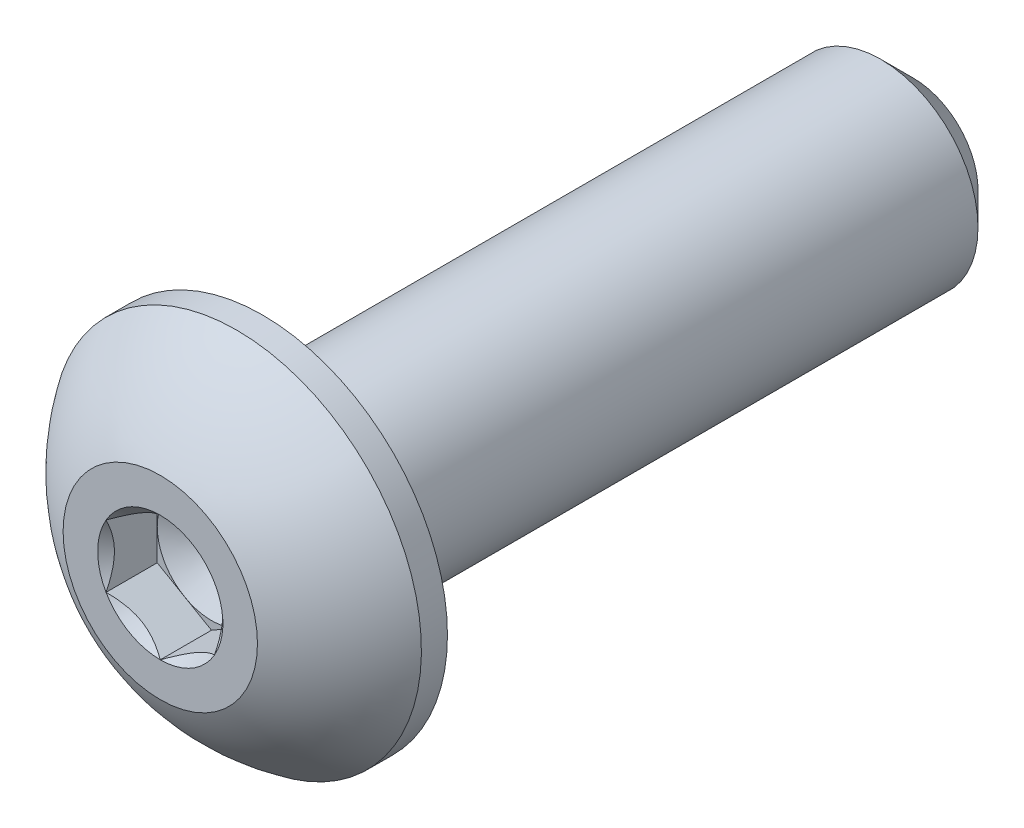
ISO-10303-21;
HEADER;
FILE_DESCRIPTION(('STEP AP214'),'2;1');
FILE_NAME('part.step','',(''),(''),'','','');
FILE_SCHEMA(('AUTOMOTIVE_DESIGN { 1 0 10303 214 1 1 1 1 }'));
ENDSEC;
DATA;
#1=APPLICATION_CONTEXT('core data for automotive mechanical design processes');
#2=APPLICATION_PROTOCOL_DEFINITION('international standard','automotive_design',2000,#1);
#3=PRODUCT_CONTEXT('',#1,'mechanical');
#4=PRODUCT('Part','Part','',(#3));
#5=PRODUCT_RELATED_PRODUCT_CATEGORY('part','',(#4));
#6=PRODUCT_DEFINITION_FORMATION('','',#4);
#7=PRODUCT_DEFINITION_CONTEXT('part definition',#1,'design');
#8=PRODUCT_DEFINITION('design','',#6,#7);
#9=PRODUCT_DEFINITION_SHAPE('','',#8);
#10=(LENGTH_UNIT() NAMED_UNIT(*) SI_UNIT(.MILLI.,.METRE.));
#11=(NAMED_UNIT(*) PLANE_ANGLE_UNIT() SI_UNIT($,.RADIAN.));
#12=(NAMED_UNIT(*) SI_UNIT($,.STERADIAN.) SOLID_ANGLE_UNIT());
#13=UNCERTAINTY_MEASURE_WITH_UNIT(LENGTH_MEASURE(1.E-05),#10,'distance_accuracy_value','');
#14=(GEOMETRIC_REPRESENTATION_CONTEXT(3) GLOBAL_UNCERTAINTY_ASSIGNED_CONTEXT((#13)) GLOBAL_UNIT_ASSIGNED_CONTEXT((#10,
#11,#12)) REPRESENTATION_CONTEXT('',''));
#15=CARTESIAN_POINT('',(0.,0.,0.));
#16=DIRECTION('',(0.,0.,1.));
#17=DIRECTION('',(1.,0.,0.));
#18=AXIS2_PLACEMENT_3D('',#15,#16,#17);
#19=CARTESIAN_POINT('',(0.79375,-1.3748153285078,0.7493));
#20=DIRECTION('',(0.,0.,1.));
#21=DIRECTION('',(1.,0.,0.));
#22=AXIS2_PLACEMENT_3D('',#19,#20,#21);
#23=PLANE('',#22);
#24=CARTESIAN_POINT('',(0.,0.,0.7493));
#25=DIRECTION('',(0.,0.,1.));
#26=DIRECTION('',(1.,0.,0.));
#27=AXIS2_PLACEMENT_3D('',#24,#25,#26);
#28=CIRCLE('',#27,0.79375);
#29=CARTESIAN_POINT('',(0.79375,0.,0.7493));
#30=VERTEX_POINT('',#29);
#31=CARTESIAN_POINT('',(0.396875,0.687407664253898,0.7493));
#32=VERTEX_POINT('',#31);
#33=EDGE_CURVE('E42',#30,#32,#28,.T.);
#34=ORIENTED_EDGE('',*,*,#33,.F.);
#35=DIRECTION('',(0.,1.,0.));
#36=VECTOR('',#35,1.);
#37=CARTESIAN_POINT('',(0.79375,-0.458271776169264,0.7493));
#38=LINE('',#37,#36);
#39=CARTESIAN_POINT('',(0.79375,0.458271776169267,0.7493));
#40=VERTEX_POINT('',#39);
#41=EDGE_CURVE('E112',#30,#40,#38,.T.);
#42=ORIENTED_EDGE('',*,*,#41,.T.);
#43=DIRECTION('',(-0.866025403784438,0.5,0.));
#44=VECTOR('',#43,1.);
#45=CARTESIAN_POINT('',(0.79375,0.458271776169267,0.7493));
#46=LINE('',#45,#44);
#47=EDGE_CURVE('E115',#40,#32,#46,.T.);
#48=ORIENTED_EDGE('',*,*,#47,.T.);
#49=EDGE_LOOP('',(#34,#42,#48));
#50=FACE_BOUND('',#49,.T.);
#51=ADVANCED_FACE('F31',(#50),#23,.T.);
#52=CARTESIAN_POINT('',(-0.396875,0.687407664253899,0.7493));
#53=VERTEX_POINT('',#52);
#54=EDGE_CURVE('E11',#32,#53,#28,.T.);
#55=ORIENTED_EDGE('',*,*,#54,.F.);
#56=CARTESIAN_POINT('',(0.,0.916543552338533,0.7493));
#57=VERTEX_POINT('',#56);
#58=EDGE_CURVE('E129',#32,#57,#46,.T.);
#59=ORIENTED_EDGE('',*,*,#58,.T.);
#60=DIRECTION('',(-0.866025403784439,-0.5,0.));
#61=VECTOR('',#60,1.);
#62=CARTESIAN_POINT('',(0.,0.916543552338533,0.7493));
#63=LINE('',#62,#61);
#64=EDGE_CURVE('E135',#57,#53,#63,.T.);
#65=ORIENTED_EDGE('',*,*,#64,.T.);
#66=EDGE_LOOP('',(#55,#59,#65));
#67=FACE_BOUND('',#66,.T.);
#68=ADVANCED_FACE('F191',(#67),#23,.T.);
#69=CARTESIAN_POINT('',(-0.79375,0.,0.7493));
#70=VERTEX_POINT('',#69);
#71=EDGE_CURVE('E40',#53,#70,#28,.T.);
#72=ORIENTED_EDGE('',*,*,#71,.F.);
#73=CARTESIAN_POINT('',(-0.79375,0.458271776169267,0.7493));
#74=VERTEX_POINT('',#73);
#75=EDGE_CURVE('E134',#53,#74,#63,.T.);
#76=ORIENTED_EDGE('',*,*,#75,.T.);
#77=DIRECTION('',(0.,-1.,0.));
#78=VECTOR('',#77,1.);
#79=CARTESIAN_POINT('',(-0.79375,0.458271776169267,0.7493));
#80=LINE('',#79,#78);
#81=EDGE_CURVE('E139',#74,#70,#80,.T.);
#82=ORIENTED_EDGE('',*,*,#81,.T.);
#83=EDGE_LOOP('',(#72,#76,#82));
#84=FACE_BOUND('',#83,.T.);
#85=ADVANCED_FACE('F196',(#84),#23,.T.);
#86=CARTESIAN_POINT('',(-0.396875,-0.687407664253898,0.7493));
#87=VERTEX_POINT('',#86);
#88=EDGE_CURVE('E226',#70,#87,#28,.T.);
#89=ORIENTED_EDGE('',*,*,#88,.F.);
#90=CARTESIAN_POINT('',(-0.79375,-0.458271776169264,0.7493));
#91=VERTEX_POINT('',#90);
#92=EDGE_CURVE('E138',#70,#91,#80,.T.);
#93=ORIENTED_EDGE('',*,*,#92,.T.);
#94=DIRECTION('',(0.866025403784439,-0.5,0.));
#95=VECTOR('',#94,1.);
#96=CARTESIAN_POINT('',(-0.79375,-0.458271776169264,0.7493));
#97=LINE('',#96,#95);
#98=EDGE_CURVE('E231',#91,#87,#97,.T.);
#99=ORIENTED_EDGE('',*,*,#98,.T.);
#100=EDGE_LOOP('',(#89,#93,#99));
#101=FACE_BOUND('',#100,.T.);
#102=ADVANCED_FACE('F214',(#101),#23,.T.);
#103=CARTESIAN_POINT('',(0.396874999999999,-0.687407664253897,0.7493));
#104=VERTEX_POINT('',#103);
#105=EDGE_CURVE('E49',#87,#104,#28,.T.);
#106=ORIENTED_EDGE('',*,*,#105,.F.);
#107=CARTESIAN_POINT('',(0.,-0.916543552338529,0.7493));
#108=VERTEX_POINT('',#107);
#109=EDGE_CURVE('E223',#87,#108,#97,.T.);
#110=ORIENTED_EDGE('',*,*,#109,.T.);
#111=DIRECTION('',(0.866025403784439,0.5,0.));
#112=VECTOR('',#111,1.);
#113=CARTESIAN_POINT('',(0.,-0.916543552338529,0.7493));
#114=LINE('',#113,#112);
#115=EDGE_CURVE('E124',#108,#104,#114,.T.);
#116=ORIENTED_EDGE('',*,*,#115,.T.);
#117=EDGE_LOOP('',(#106,#110,#116));
#118=FACE_BOUND('',#117,.T.);
#119=ADVANCED_FACE('F203',(#118),#23,.T.);
#120=CARTESIAN_POINT('',(0.,0.,0.));
#121=DIRECTION('',(0.,0.,-1.));
#122=DIRECTION('',(0.,1.,0.));
#123=AXIS2_PLACEMENT_3D('',#120,#121,#122);
#124=CYLINDRICAL_SURFACE('',#123,1.4224);
#125=CARTESIAN_POINT('',(0.,0.,-9.04875));
#126=DIRECTION('',(0.,0.,-1.));
#127=DIRECTION('',(0.,1.,0.));
#128=AXIS2_PLACEMENT_3D('',#125,#126,#127);
#129=CIRCLE('',#128,1.4224);
#130=CARTESIAN_POINT('',(0.,1.4224,-9.04875));
#131=VERTEX_POINT('',#130);
#132=EDGE_CURVE('E35',#131,#131,#129,.F.);
#133=ORIENTED_EDGE('',*,*,#132,.T.);
#134=EDGE_LOOP('',(#133));
#135=FACE_BOUND('',#134,.T.);
#136=CARTESIAN_POINT('',(0.,0.,0.));
#137=DIRECTION('',(0.,0.,1.));
#138=DIRECTION('',(1.,0.,0.));
#139=AXIS2_PLACEMENT_3D('',#136,#137,#138);
#140=CIRCLE('',#139,1.4224);
#141=CARTESIAN_POINT('',(1.4224,0.,0.));
#142=VERTEX_POINT('',#141);
#143=EDGE_CURVE('E166',#142,#142,#140,.F.);
#144=ORIENTED_EDGE('',*,*,#143,.T.);
#145=EDGE_LOOP('',(#144));
#146=FACE_BOUND('',#145,.T.);
#147=ADVANCED_FACE('F175',(#135,#146),#124,.T.);
#148=CARTESIAN_POINT('',(0.,0.,-9.525));
#149=DIRECTION('',(0.,0.,-1.));
#150=DIRECTION('',(0.,1.,0.));
#151=AXIS2_PLACEMENT_3D('',#148,#149,#150);
#152=PLANE('',#151);
#153=CARTESIAN_POINT('',(0.,0.,-9.525));
#154=DIRECTION('',(0.,0.,-1.));
#155=DIRECTION('',(0.,1.,0.));
#156=AXIS2_PLACEMENT_3D('',#153,#154,#155);
#157=CIRCLE('',#156,0.94615);
#158=CARTESIAN_POINT('',(0.,0.946150000000001,-9.525));
#159=VERTEX_POINT('',#158);
#160=EDGE_CURVE('E168',#159,#159,#157,.T.);
#161=ORIENTED_EDGE('',*,*,#160,.T.);
#162=EDGE_LOOP('',(#161));
#163=FACE_BOUND('',#162,.T.);
#164=ADVANCED_FACE('F181',(#163),#152,.T.);
#165=CARTESIAN_POINT('',(0.,0.,-9.525));
#166=DIRECTION('',(0.,0.,1.));
#167=DIRECTION('',(0.,-1.,0.));
#168=AXIS2_PLACEMENT_3D('',#165,#166,#167);
#169=CONICAL_SURFACE('',#168,0.94615,0.785398163397445);
#170=ORIENTED_EDGE('',*,*,#132,.F.);
#171=EDGE_LOOP('',(#170));
#172=FACE_BOUND('',#171,.T.);
#173=ORIENTED_EDGE('',*,*,#160,.F.);
#174=EDGE_LOOP('',(#173));
#175=FACE_BOUND('',#174,.T.);
#176=ADVANCED_FACE('F33',(#172,#175),#169,.T.);
#177=CARTESIAN_POINT('',(0.,0.,9.14977821515092));
#178=DIRECTION('',(0.,0.,-1.));
#179=DIRECTION('',(-1.,0.,0.));
#180=AXIS2_PLACEMENT_3D('',#177,#178,#179);
#181=CYLINDRICAL_SURFACE('',#180,2.7051);
#182=CARTESIAN_POINT('',(0.,0.,0.381));
#183=DIRECTION('',(0.,0.,-1.));
#184=DIRECTION('',(0.,1.,0.));
#185=AXIS2_PLACEMENT_3D('',#182,#183,#184);
#186=CIRCLE('',#185,2.7051);
#187=CARTESIAN_POINT('',(0.,2.7051,0.381));
#188=VERTEX_POINT('',#187);
#189=EDGE_CURVE('E160',#188,#188,#186,.T.);
#190=ORIENTED_EDGE('',*,*,#189,.T.);
#191=EDGE_LOOP('',(#190));
#192=FACE_BOUND('',#191,.T.);
#193=CARTESIAN_POINT('',(0.,0.,0.));
#194=DIRECTION('',(0.,0.,1.));
#195=DIRECTION('',(1.,0.,0.));
#196=AXIS2_PLACEMENT_3D('',#193,#194,#195);
#197=CIRCLE('',#196,2.7051);
#198=CARTESIAN_POINT('',(2.7051,0.,0.));
#199=VERTEX_POINT('',#198);
#200=EDGE_CURVE('E163',#199,#199,#197,.T.);
#201=ORIENTED_EDGE('',*,*,#200,.T.);
#202=EDGE_LOOP('',(#201));
#203=FACE_BOUND('',#202,.T.);
#204=ADVANCED_FACE('F180',(#192,#203),#181,.T.);
#205=CARTESIAN_POINT('',(0.,0.,0.));
#206=DIRECTION('',(0.,0.,1.));
#207=DIRECTION('',(1.,0.,0.));
#208=AXIS2_PLACEMENT_3D('',#205,#206,#207);
#209=PLANE('',#208);
#210=ORIENTED_EDGE('',*,*,#143,.F.);
#211=EDGE_LOOP('',(#210));
#212=FACE_BOUND('',#211,.T.);
#213=ORIENTED_EDGE('',*,*,#200,.F.);
#214=EDGE_LOOP('',(#213));
#215=FACE_BOUND('',#214,.T.);
#216=ADVANCED_FACE('F186',(#212,#215),#209,.F.);
#217=CARTESIAN_POINT('',(0.,0.,-1.42882215909091));
#218=DIRECTION('',(0.,0.,-1.));
#219=DIRECTION('',(0.,1.,0.));
#220=AXIS2_PLACEMENT_3D('',#217,#218,#219);
#221=SPHERICAL_SURFACE('',#220,3.25469234452912);
#222=ORIENTED_EDGE('',*,*,#189,.F.);
#223=EDGE_LOOP('',(#222));
#224=FACE_BOUND('',#223,.T.);
#225=CARTESIAN_POINT('',(0.,0.,1.4986));
#226=DIRECTION('',(0.,0.,-1.));
#227=DIRECTION('',(0.,1.,0.));
#228=AXIS2_PLACEMENT_3D('',#225,#226,#227);
#229=CIRCLE('',#228,1.4224);
#230=CARTESIAN_POINT('',(0.,1.4224,1.4986));
#231=VERTEX_POINT('',#230);
#232=EDGE_CURVE('E146',#231,#231,#229,.T.);
#233=ORIENTED_EDGE('',*,*,#232,.T.);
#234=EDGE_LOOP('',(#233));
#235=FACE_BOUND('',#234,.T.);
#236=ADVANCED_FACE('F425',(#224,#235),#221,.T.);
#237=CARTESIAN_POINT('',(0.,0.,1.4986));
#238=DIRECTION('',(0.,0.,1.));
#239=DIRECTION('',(1.,0.,0.));
#240=AXIS2_PLACEMENT_3D('',#237,#238,#239);
#241=PLANE('',#240);
#242=CARTESIAN_POINT('',(0.,0.,1.4986));
#243=DIRECTION('',(0.,0.,1.));
#244=DIRECTION('',(1.,0.,0.));
#245=AXIS2_PLACEMENT_3D('',#242,#243,#244);
#246=CIRCLE('',#245,0.916543552338529);
#247=CARTESIAN_POINT('',(0.79375,0.458271776169263,1.4986));
#248=VERTEX_POINT('',#247);
#249=CARTESIAN_POINT('',(0.,0.916543552338529,1.4986));
#250=VERTEX_POINT('',#249);
#251=EDGE_CURVE('E486',#248,#250,#246,.T.);
#252=ORIENTED_EDGE('',*,*,#251,.F.);
#253=CARTESIAN_POINT('',(0.79375,-0.458271776169264,1.4986));
#254=VERTEX_POINT('',#253);
#255=EDGE_CURVE('E490',#254,#248,#246,.T.);
#256=ORIENTED_EDGE('',*,*,#255,.F.);
#257=CARTESIAN_POINT('',(0.,-0.916543552338529,1.4986));
#258=VERTEX_POINT('',#257);
#259=EDGE_CURVE('E496',#258,#254,#246,.T.);
#260=ORIENTED_EDGE('',*,*,#259,.F.);
#261=CARTESIAN_POINT('',(-0.79375,-0.458271776169262,1.4986));
#262=VERTEX_POINT('',#261);
#263=EDGE_CURVE('E499',#262,#258,#246,.T.);
#264=ORIENTED_EDGE('',*,*,#263,.F.);
#265=CARTESIAN_POINT('',(-0.793749999999995,0.45827177616927,1.4986));
#266=VERTEX_POINT('',#265);
#267=EDGE_CURVE('E56',#266,#262,#246,.T.);
#268=ORIENTED_EDGE('',*,*,#267,.F.);
#269=EDGE_CURVE('E491',#250,#266,#246,.T.);
#270=ORIENTED_EDGE('',*,*,#269,.F.);
#271=EDGE_LOOP('',(#252,#256,#260,#264,#268,#270));
#272=FACE_BOUND('',#271,.T.);
#273=ORIENTED_EDGE('',*,*,#232,.F.);
#274=EDGE_LOOP('',(#273));
#275=FACE_BOUND('',#274,.T.);
#276=ADVANCED_FACE('F403',(#272,#275),#241,.T.);
#277=CARTESIAN_POINT('',(0.,0.,1.4986));
#278=DIRECTION('',(0.,0.,1.));
#279=DIRECTION('',(1.,0.,0.));
#280=AXIS2_PLACEMENT_3D('',#277,#278,#279);
#281=CONICAL_SURFACE('',#280,0.916543552338529,0.78539816339745);
#282=ORIENTED_EDGE('',*,*,#259,.T.);
#283=CARTESIAN_POINT('',(-0.000200000000000455,-0.916659022392367,1.4987154918722));
#284=CARTESIAN_POINT('',(0.0270936731708993,-0.900901012839974,1.48296677881996));
#285=CARTESIAN_POINT('',(0.0548437622982907,-0.884879491412239,1.46814254758418));
#286=CARTESIAN_POINT('',(0.111429749536839,-0.852209556447702,1.44099903778594));
#287=CARTESIAN_POINT('',(0.140271036646688,-0.835558031571056,1.42869487372838));
#288=CARTESIAN_POINT('',(0.198428320979554,-0.801980907806138,1.4076173665706));
#289=CARTESIAN_POINT('',(0.227729485202779,-0.78506387275429,1.39879100814755));
#290=CARTESIAN_POINT('',(0.286976842886976,-0.750857394846545,1.38519123872424));
#291=CARTESIAN_POINT('',(0.316921224361637,-0.733568998141432,1.38040766812998));
#292=CARTESIAN_POINT('',(0.368524622466451,-0.703775762354518,1.37609340945595));
#293=CARTESIAN_POINT('',(0.390116468258511,-0.691309704374172,1.37545527141097));
#294=CARTESIAN_POINT('',(0.433258367277031,-0.666401717362478,1.37652613979119));
#295=CARTESIAN_POINT('',(0.454808410236484,-0.65395979425879,1.37823566388179));
#296=CARTESIAN_POINT('',(0.519150845544782,-0.616811671913228,1.38677279115859));
#297=CARTESIAN_POINT('',(0.561623053980694,-0.592290330939676,1.39700991913679));
#298=CARTESIAN_POINT('',(0.636174390780281,-0.549248096569988,1.42171858984055));
#299=CARTESIAN_POINT('',(0.668602787817666,-0.530525552811065,1.43489617467531));
#300=CARTESIAN_POINT('',(0.732189146461483,-0.49381395153127,1.46458103995168));
#301=CARTESIAN_POINT('',(0.763350854631517,-0.475822730930892,1.48107748789317));
#302=CARTESIAN_POINT('',(0.79395,-0.458156306115426,1.4987154918722));
#303=B_SPLINE_CURVE_WITH_KNOTS('',3,(#283,#284,#285,#286,#287,#288,#289,#290,#291,#292,#293,
#294,#295,#296,#297,#298,#299,#300,#301,#302),.UNSPECIFIED.,.F.,.F.,(4,2,2,2,2,2,2,2,2,4),(0.,
0.105768699105621,0.21215429718622,0.316848842533858,0.421279499712345,0.495991864977073,
0.570720707151282,0.720221070373883,0.839150369964801,0.957697614118391),.UNSPECIFIED.);
#304=EDGE_CURVE('E256',#258,#254,#303,.T.);
#305=ORIENTED_EDGE('',*,*,#304,.F.);
#306=EDGE_LOOP('',(#282,#305));
#307=FACE_BOUND('',#306,.T.);
#308=ADVANCED_FACE('F212',(#307),#281,.F.);
#309=ORIENTED_EDGE('',*,*,#255,.T.);
#310=CARTESIAN_POINT('',(0.79375,-0.930523312873779,1.80513154686903));
#311=CARTESIAN_POINT('',(0.79375,-0.907938717568108,1.78795163801993));
#312=CARTESIAN_POINT('',(0.79375,-0.885230100372018,1.77093524884748));
#313=CARTESIAN_POINT('',(0.79375,-0.83951390138625,1.73729754968507));
#314=CARTESIAN_POINT('',(0.79375,-0.81650624817287,1.72067633686699));
#315=CARTESIAN_POINT('',(0.79375,-0.746621435652652,1.67127015014611));
#316=CARTESIAN_POINT('',(0.79375,-0.699225496572676,1.63920694226179));
#317=CARTESIAN_POINT('',(0.79375,-0.599729870318619,1.57610938356628));
#318=CARTESIAN_POINT('',(0.79375,-0.547518111602845,1.54524980287807));
#319=CARTESIAN_POINT('',(0.79375,-0.440465997521066,1.48869431939161));
#320=CARTESIAN_POINT('',(0.79375,-0.385635319588842,1.462980990208));
#321=CARTESIAN_POINT('',(0.79375,-0.303490919645501,1.43151828592316));
#322=CARTESIAN_POINT('',(0.79375,-0.277428588623871,1.42251658488986));
#323=CARTESIAN_POINT('',(0.79375,-0.224660266267594,1.40660365805206));
#324=CARTESIAN_POINT('',(0.79375,-0.197954232107697,1.39969257175189));
#325=CARTESIAN_POINT('',(0.79375,-0.144516677526958,1.38844073487269));
#326=CARTESIAN_POINT('',(0.79375,-0.117794877403843,1.38405455104384));
#327=CARTESIAN_POINT('',(0.79375,-0.0640385307880295,1.37793807645136));
#328=CARTESIAN_POINT('',(0.79375,-0.037003941658247,1.37620815217119));
#329=CARTESIAN_POINT('',(0.79375,0.0160384595788292,1.37554283034023));
#330=CARTESIAN_POINT('',(0.79375,0.0420449606060605,1.37650050108268));
#331=CARTESIAN_POINT('',(0.79375,0.093845497213574,1.38091790993338));
#332=CARTESIAN_POINT('',(0.79375,0.11963949213758,1.38437811607282));
#333=CARTESIAN_POINT('',(0.79375,0.171261622869057,1.39366770326333));
#334=CARTESIAN_POINT('',(0.79375,0.197082302323078,1.3995378826003));
#335=CARTESIAN_POINT('',(0.79375,0.248157270984135,1.4133304606982));
#336=CARTESIAN_POINT('',(0.79375,0.273411601594531,1.42125270890617));
#337=CARTESIAN_POINT('',(0.79375,0.352183480672703,1.44896346635406));
#338=CARTESIAN_POINT('',(0.79375,0.404598779993784,1.4718769639291));
#339=CARTESIAN_POINT('',(0.79375,0.506973354577988,1.5228423731992));
#340=CARTESIAN_POINT('',(0.79375,0.556923045144656,1.55091259799278));
#341=CARTESIAN_POINT('',(0.79375,0.652394168745675,1.60884556234195));
#342=CARTESIAN_POINT('',(0.79375,0.698012407471607,1.63855075951651));
#343=CARTESIAN_POINT('',(0.79375,0.765221422184928,1.68448125421725));
#344=CARTESIAN_POINT('',(0.79375,0.787334753284685,1.69995518303451));
#345=CARTESIAN_POINT('',(0.79375,0.831258721493259,1.73131476145367));
#346=CARTESIAN_POINT('',(0.79375,0.853069439825473,1.74720029716127));
#347=CARTESIAN_POINT('',(0.79375,0.874754064753108,1.76325657308564));
#348=B_SPLINE_CURVE_WITH_KNOTS('',3,(#310,#311,#312,#313,#314,#315,#316,#317,#318,#319,#320,
#321,#322,#323,#324,#325,#326,#327,#328,#329,#330,#331,#332,#333,#334,#335,#336,#337,#338,#339,
#340,#341,#342,#343,#344,#345,#346,#347),.UNSPECIFIED.,.F.,.F.,(4,2,2,2,2,2,2,2,2,2,2,2,2,2,2,2,
2,2,4),(0.,0.0851267212699211,0.170274162697199,0.341867540062669,0.523672188154065,
0.704850381262152,0.787500098686151,0.870155330015478,0.951272603586192,1.03240106788106,
1.11034793766582,1.18830938906372,1.26764895162694,1.34698269497801,1.51809534529198,
1.68982784691028,1.85305831881697,1.93402417500375,2.01496786175293),.UNSPECIFIED.);
#349=EDGE_CURVE('E264',#254,#248,#348,.T.);
#350=ORIENTED_EDGE('',*,*,#349,.F.);
#351=EDGE_LOOP('',(#309,#350));
#352=FACE_BOUND('',#351,.T.);
#353=ADVANCED_FACE('F388',(#352),#281,.F.);
#354=ORIENTED_EDGE('',*,*,#251,.T.);
#355=CARTESIAN_POINT('',(0.793949999999999,0.458156306115429,1.4987154918722));
#356=CARTESIAN_POINT('',(0.7666563268291,0.473914315667822,1.48296677881996));
#357=CARTESIAN_POINT('',(0.738906237701709,0.489935837095558,1.46814254758418));
#358=CARTESIAN_POINT('',(0.68232025046316,0.522605772060094,1.44099903778594));
#359=CARTESIAN_POINT('',(0.653478963353312,0.53925729693674,1.42869487372838));
#360=CARTESIAN_POINT('',(0.595321679020446,0.572834420701658,1.4076173665706));
#361=CARTESIAN_POINT('',(0.566020514797221,0.589751455753507,1.39879100814755));
#362=CARTESIAN_POINT('',(0.506773157113025,0.623957933661252,1.38519123872424));
#363=CARTESIAN_POINT('',(0.476828775638364,0.641246330366364,1.38040766812999));
#364=CARTESIAN_POINT('',(0.425225377533549,0.671039566153278,1.37609340945595));
#365=CARTESIAN_POINT('',(0.40363353174149,0.683505624133624,1.37545527141097));
#366=CARTESIAN_POINT('',(0.360491632722969,0.708413611145319,1.3765261397912));
#367=CARTESIAN_POINT('',(0.338941589763516,0.720855534249007,1.37823566388179));
#368=CARTESIAN_POINT('',(0.274599154455218,0.758003656594569,1.3867727911586));
#369=CARTESIAN_POINT('',(0.232126946019306,0.782524997568121,1.3970099191368));
#370=CARTESIAN_POINT('',(0.157575609219719,0.825567231937809,1.42171858984055));
#371=CARTESIAN_POINT('',(0.125147212182333,0.844289775696731,1.43489617467531));
#372=CARTESIAN_POINT('',(0.0615608535385166,0.881001376976527,1.46458103995168));
#373=CARTESIAN_POINT('',(0.0303991453684829,0.898992597576905,1.48107748789317));
#374=CARTESIAN_POINT('',(-0.000200000000000255,0.916659022392371,1.4987154918722));
#375=B_SPLINE_CURVE_WITH_KNOTS('',3,(#355,#356,#357,#358,#359,#360,#361,#362,#363,#364,#365,
#366,#367,#368,#369,#370,#371,#372,#373,#374),.UNSPECIFIED.,.F.,.F.,(4,2,2,2,2,2,2,2,2,4),(0.,
0.105768699105621,0.212154297186219,0.316848842533857,0.421279499712344,0.495991864977072,
0.570720707151281,0.720221070373882,0.8391503699648,0.957697614118391),.UNSPECIFIED.);
#376=EDGE_CURVE('E271',#248,#250,#375,.T.);
#377=ORIENTED_EDGE('',*,*,#376,.F.);
#378=EDGE_LOOP('',(#354,#377));
#379=FACE_BOUND('',#378,.T.);
#380=ADVANCED_FACE('F380',(#379),#281,.F.);
#381=ORIENTED_EDGE('',*,*,#269,.T.);
#382=CARTESIAN_POINT('',(0.00019999999999984,0.916659022392371,1.4987154918722));
#383=CARTESIAN_POINT('',(-0.0270936731709001,0.900901012839978,1.48296677881996));
#384=CARTESIAN_POINT('',(-0.0548437622982915,0.884879491412243,1.46814254758418));
#385=CARTESIAN_POINT('',(-0.11142974953684,0.852209556447706,1.44099903778594));
#386=CARTESIAN_POINT('',(-0.140271036646689,0.835558031571059,1.42869487372838));
#387=CARTESIAN_POINT('',(-0.198428320979556,0.801980907806141,1.4076173665706));
#388=CARTESIAN_POINT('',(-0.22772948520278,0.785063872754293,1.39879100814755));
#389=CARTESIAN_POINT('',(-0.286976842886977,0.750857394846548,1.38519123872424));
#390=CARTESIAN_POINT('',(-0.316921224361638,0.733568998141436,1.38040766812999));
#391=CARTESIAN_POINT('',(-0.368524622466453,0.703775762354521,1.37609340945595));
#392=CARTESIAN_POINT('',(-0.390116468258512,0.691309704374175,1.37545527141097));
#393=CARTESIAN_POINT('',(-0.433258367277033,0.666401717362481,1.3765261397912));
#394=CARTESIAN_POINT('',(-0.454808410236486,0.653959794258792,1.37823566388179));
#395=CARTESIAN_POINT('',(-0.519150845544784,0.61681167191323,1.3867727911586));
#396=CARTESIAN_POINT('',(-0.561623053980697,0.592290330939678,1.3970099191368));
#397=CARTESIAN_POINT('',(-0.636174390780283,0.549248096569991,1.42171858984055));
#398=CARTESIAN_POINT('',(-0.668602787817668,0.530525552811068,1.43489617467531));
#399=CARTESIAN_POINT('',(-0.732189146461484,0.493813951531273,1.46458103995168));
#400=CARTESIAN_POINT('',(-0.763350854631517,0.475822730930895,1.48107748789317));
#401=CARTESIAN_POINT('',(-0.79395,0.45815630611543,1.4987154918722));
#402=B_SPLINE_CURVE_WITH_KNOTS('',3,(#382,#383,#384,#385,#386,#387,#388,#389,#390,#391,#392,
#393,#394,#395,#396,#397,#398,#399,#400,#401),.UNSPECIFIED.,.F.,.F.,(4,2,2,2,2,2,2,2,2,4),(0.,
0.105768699105622,0.21215429718622,0.316848842533859,0.421279499712347,0.495991864977074,
0.570720707151284,0.720221070373885,0.839150369964802,0.957697614118391),.UNSPECIFIED.);
#403=EDGE_CURVE('E276',#250,#266,#402,.T.);
#404=ORIENTED_EDGE('',*,*,#403,.F.);
#405=EDGE_LOOP('',(#381,#404));
#406=FACE_BOUND('',#405,.T.);
#407=ADVANCED_FACE('F373',(#406),#281,.F.);
#408=ORIENTED_EDGE('',*,*,#267,.T.);
#409=CARTESIAN_POINT('',(-0.79375,-0.930523312845418,1.80513154684746));
#410=CARTESIAN_POINT('',(-0.79375,-0.907938717540552,1.78795163799919));
#411=CARTESIAN_POINT('',(-0.79375,-0.88523010034527,1.77093524882756));
#412=CARTESIAN_POINT('',(-0.79375,-0.839513901361125,1.73729754966682));
#413=CARTESIAN_POINT('',(-0.79375,-0.816506248148561,1.72067633684956));
#414=CARTESIAN_POINT('',(-0.79375,-0.746621435630839,1.67127015013118));
#415=CARTESIAN_POINT('',(-0.79375,-0.69922549655256,1.63920694224851));
#416=CARTESIAN_POINT('',(-0.79375,-0.599729870302204,1.57610938355642));
#417=CARTESIAN_POINT('',(-0.79375,-0.547518111588444,1.54524980286995));
#418=CARTESIAN_POINT('',(-0.79375,-0.440465997510864,1.48869431938673));
#419=CARTESIAN_POINT('',(-0.79375,-0.385635319580823,1.46298099020461));
#420=CARTESIAN_POINT('',(-0.79375,-0.30349091963912,1.43151828592086));
#421=CARTESIAN_POINT('',(-0.79375,-0.277428588616795,1.4225165848875));
#422=CARTESIAN_POINT('',(-0.79375,-0.224660266259103,1.40660365804972));
#423=CARTESIAN_POINT('',(-0.79375,-0.197954232098486,1.39969257174964));
#424=CARTESIAN_POINT('',(-0.79375,-0.144516677516331,1.38844073487076));
#425=CARTESIAN_POINT('',(-0.79375,-0.11779487739252,1.38405455104215));
#426=CARTESIAN_POINT('',(-0.79375,-0.0640385307753352,1.37793807645032));
#427=CARTESIAN_POINT('',(-0.79375,-0.0370039416448776,1.37620815217055));
#428=CARTESIAN_POINT('',(-0.79375,0.0160384595934048,1.37554283034051));
#429=CARTESIAN_POINT('',(-0.79375,0.0420449606211689,1.37650050108347));
#430=CARTESIAN_POINT('',(-0.79375,0.0938454972296932,1.38091790993526));
#431=CARTESIAN_POINT('',(-0.79375,0.119639492154177,1.38437811607528));
#432=CARTESIAN_POINT('',(-0.79375,0.171261622886597,1.39366770326701));
#433=CARTESIAN_POINT('',(-0.79375,0.197082302341082,1.39953788260463));
#434=CARTESIAN_POINT('',(-0.79375,0.24815727100302,1.41333046070383));
#435=CARTESIAN_POINT('',(-0.79375,0.273411601613832,1.42125270891245));
#436=CARTESIAN_POINT('',(-0.793750000000001,0.352183480696166,1.44896346636341));
#437=CARTESIAN_POINT('',(-0.79375,0.404598780020782,1.47187696394126));
#438=CARTESIAN_POINT('',(-0.79375,0.506973354611786,1.52284237321731));
#439=CARTESIAN_POINT('',(-0.79375,0.556923045181717,1.55091259801402));
#440=CARTESIAN_POINT('',(-0.79375,0.652394168788597,1.60884556236918));
#441=CARTESIAN_POINT('',(-0.793750000000001,0.69801240751715,1.63855075954657));
#442=CARTESIAN_POINT('',(-0.793750000000001,0.765221422234345,1.68448125425154));
#443=CARTESIAN_POINT('',(-0.793750000000001,0.787334753335375,1.69995518307021));
#444=CARTESIAN_POINT('',(-0.793750000000001,0.831258721546487,1.73131476149216));
#445=CARTESIAN_POINT('',(-0.793750000000001,0.853069439879965,1.74720029720116));
#446=CARTESIAN_POINT('',(-0.793750000000001,0.874754064808862,1.76325657312693));
#447=B_SPLINE_CURVE_WITH_KNOTS('',3,(#409,#410,#411,#412,#413,#414,#415,#416,#417,#418,#419,
#420,#421,#422,#423,#424,#425,#426,#427,#428,#429,#430,#431,#432,#433,#434,#435,#436,#437,#438,
#439,#440,#441,#442,#443,#444,#445,#446),.UNSPECIFIED.,.F.,.F.,(4,2,2,2,2,2,2,2,2,2,2,2,2,2,2,2,
2,2,4),(0.,0.085126721266486,0.170274162690328,0.341867540048798,0.523672188132332,
0.704850381232633,0.787500098658654,0.87015532999,0.951272603562646,1.03240106785945,
1.11034793764585,1.1883093890454,1.26764895161041,1.34698269496326,1.51809534529028,
1.68982784692171,1.85305831883963,1.93402417503194,2.01496786178666),.UNSPECIFIED.);
#448=EDGE_CURVE('E243',#266,#262,#447,.F.);
#449=ORIENTED_EDGE('',*,*,#448,.F.);
#450=EDGE_LOOP('',(#408,#449));
#451=FACE_BOUND('',#450,.T.);
#452=ADVANCED_FACE('F210',(#451),#281,.F.);
#453=ORIENTED_EDGE('',*,*,#263,.T.);
#454=CARTESIAN_POINT('',(-0.79395,-0.458156306115426,1.4987154918722));
#455=CARTESIAN_POINT('',(-0.7666563268291,-0.473914315667819,1.48296677881996));
#456=CARTESIAN_POINT('',(-0.738906237701709,-0.489935837095554,1.46814254758418));
#457=CARTESIAN_POINT('',(-0.68232025046316,-0.522605772060091,1.44099903778594));
#458=CARTESIAN_POINT('',(-0.653478963353312,-0.539257296936738,1.42869487372838));
#459=CARTESIAN_POINT('',(-0.595321679020445,-0.572834420701656,1.4076173665706));
#460=CARTESIAN_POINT('',(-0.56602051479722,-0.589751455753504,1.39879100814755));
#461=CARTESIAN_POINT('',(-0.506773157113023,-0.623957933661249,1.38519123872424));
#462=CARTESIAN_POINT('',(-0.476828775638362,-0.641246330366361,1.38040766812998));
#463=CARTESIAN_POINT('',(-0.425225377533547,-0.671039566153276,1.37609340945595));
#464=CARTESIAN_POINT('',(-0.403633531741488,-0.683505624133622,1.37545527141097));
#465=CARTESIAN_POINT('',(-0.360491632722968,-0.708413611145316,1.37652613979119));
#466=CARTESIAN_POINT('',(-0.338941589763515,-0.720855534249005,1.37823566388179));
#467=CARTESIAN_POINT('',(-0.274599154455217,-0.758003656594566,1.38677279115859));
#468=CARTESIAN_POINT('',(-0.232126946019305,-0.782524997568118,1.39700991913679));
#469=CARTESIAN_POINT('',(-0.157575609219718,-0.825567231937806,1.42171858984055));
#470=CARTESIAN_POINT('',(-0.125147212182333,-0.844289775696729,1.43489617467531));
#471=CARTESIAN_POINT('',(-0.0615608535385167,-0.881001376976524,1.46458103995168));
#472=CARTESIAN_POINT('',(-0.0303991453684834,-0.898992597576901,1.48107748789317));
#473=CARTESIAN_POINT('',(0.000199999999999513,-0.916659022392367,1.4987154918722));
#474=B_SPLINE_CURVE_WITH_KNOTS('',3,(#454,#455,#456,#457,#458,#459,#460,#461,#462,#463,#464,
#465,#466,#467,#468,#469,#470,#471,#472,#473),.UNSPECIFIED.,.F.,.F.,(4,2,2,2,2,2,2,2,2,4),(0.,
0.105768699105621,0.21215429718622,0.316848842533859,0.421279499712347,0.495991864977074,
0.570720707151284,0.720221070373884,0.839150369964802,0.957697614118391),.UNSPECIFIED.);
#475=EDGE_CURVE('E233',#262,#258,#474,.T.);
#476=ORIENTED_EDGE('',*,*,#475,.F.);
#477=EDGE_LOOP('',(#453,#476));
#478=FACE_BOUND('',#477,.T.);
#479=ADVANCED_FACE('F202',(#478),#281,.F.);
#480=EDGE_CURVE('E102',#104,#30,#28,.T.);
#481=ORIENTED_EDGE('',*,*,#480,.F.);
#482=CARTESIAN_POINT('',(0.79375,-0.458271776169264,0.7493));
#483=VERTEX_POINT('',#482);
#484=EDGE_CURVE('E127',#104,#483,#114,.T.);
#485=ORIENTED_EDGE('',*,*,#484,.T.);
#486=EDGE_CURVE('E120',#483,#30,#38,.T.);
#487=ORIENTED_EDGE('',*,*,#486,.T.);
#488=EDGE_LOOP('',(#481,#485,#487));
#489=FACE_BOUND('',#488,.T.);
#490=ADVANCED_FACE('F126',(#489),#23,.T.);
#491=CARTESIAN_POINT('',(0.,-0.916543552338529,0.7493));
#492=DIRECTION('',(0.5,-0.866025403784439,0.));
#493=DIRECTION('',(0.866025403784439,0.5,0.));
#494=AXIS2_PLACEMENT_3D('',#491,#492,#493);
#495=PLANE('',#494);
#496=DIRECTION('',(0.,0.,1.));
#497=VECTOR('',#496,1.);
#498=CARTESIAN_POINT('',(0.,-0.916543552338529,0.7493));
#499=LINE('',#498,#497);
#500=EDGE_CURVE('E142',#108,#258,#499,.T.);
#501=ORIENTED_EDGE('',*,*,#500,.T.);
#502=ORIENTED_EDGE('',*,*,#304,.T.);
#503=DIRECTION('',(0.,0.,1.));
#504=VECTOR('',#503,1.);
#505=CARTESIAN_POINT('',(0.79375,-0.458271776169264,0.7493));
#506=LINE('',#505,#504);
#507=EDGE_CURVE('E154',#483,#254,#506,.T.);
#508=ORIENTED_EDGE('',*,*,#507,.F.);
#509=ORIENTED_EDGE('',*,*,#484,.F.);
#510=ORIENTED_EDGE('',*,*,#115,.F.);
#511=EDGE_LOOP('',(#501,#502,#508,#509,#510));
#512=FACE_BOUND('',#511,.T.);
#513=ADVANCED_FACE('F201',(#512),#495,.F.);
#514=CARTESIAN_POINT('',(0.79375,-0.458271776169264,0.7493));
#515=DIRECTION('',(1.,0.,0.));
#516=DIRECTION('',(0.,1.,0.));
#517=AXIS2_PLACEMENT_3D('',#514,#515,#516);
#518=PLANE('',#517);
#519=ORIENTED_EDGE('',*,*,#507,.T.);
#520=ORIENTED_EDGE('',*,*,#349,.T.);
#521=DIRECTION('',(0.,0.,1.));
#522=VECTOR('',#521,1.);
#523=CARTESIAN_POINT('',(0.79375,0.458271776169267,0.7493));
#524=LINE('',#523,#522);
#525=EDGE_CURVE('E123',#40,#248,#524,.T.);
#526=ORIENTED_EDGE('',*,*,#525,.F.);
#527=ORIENTED_EDGE('',*,*,#41,.F.);
#528=ORIENTED_EDGE('',*,*,#486,.F.);
#529=EDGE_LOOP('',(#519,#520,#526,#527,#528));
#530=FACE_BOUND('',#529,.T.);
#531=ADVANCED_FACE('F119',(#530),#518,.F.);
#532=CARTESIAN_POINT('',(0.79375,0.458271776169267,0.7493));
#533=DIRECTION('',(0.5,0.866025403784439,0.));
#534=DIRECTION('',(-0.866025403784439,0.5,0.));
#535=AXIS2_PLACEMENT_3D('',#532,#533,#534);
#536=PLANE('',#535);
#537=ORIENTED_EDGE('',*,*,#525,.T.);
#538=ORIENTED_EDGE('',*,*,#376,.T.);
#539=DIRECTION('',(0.,0.,1.));
#540=VECTOR('',#539,1.);
#541=CARTESIAN_POINT('',(0.,0.916543552338533,0.7493));
#542=LINE('',#541,#540);
#543=EDGE_CURVE('E150',#57,#250,#542,.T.);
#544=ORIENTED_EDGE('',*,*,#543,.F.);
#545=ORIENTED_EDGE('',*,*,#58,.F.);
#546=ORIENTED_EDGE('',*,*,#47,.F.);
#547=EDGE_LOOP('',(#537,#538,#544,#545,#546));
#548=FACE_BOUND('',#547,.T.);
#549=ADVANCED_FACE('F286',(#548),#536,.F.);
#550=CARTESIAN_POINT('',(0.,0.916543552338533,0.7493));
#551=DIRECTION('',(-0.5,0.866025403784439,0.));
#552=DIRECTION('',(-0.866025403784439,-0.5,0.));
#553=AXIS2_PLACEMENT_3D('',#550,#551,#552);
#554=PLANE('',#553);
#555=ORIENTED_EDGE('',*,*,#543,.T.);
#556=ORIENTED_EDGE('',*,*,#403,.T.);
#557=DIRECTION('',(0.,0.,1.));
#558=VECTOR('',#557,1.);
#559=CARTESIAN_POINT('',(-0.79375,0.458271776169267,0.7493));
#560=LINE('',#559,#558);
#561=EDGE_CURVE('E147',#74,#266,#560,.T.);
#562=ORIENTED_EDGE('',*,*,#561,.F.);
#563=ORIENTED_EDGE('',*,*,#75,.F.);
#564=ORIENTED_EDGE('',*,*,#64,.F.);
#565=EDGE_LOOP('',(#555,#556,#562,#563,#564));
#566=FACE_BOUND('',#565,.T.);
#567=ADVANCED_FACE('F282',(#566),#554,.F.);
#568=CARTESIAN_POINT('',(-0.79375,0.458271776169267,0.7493));
#569=DIRECTION('',(-1.,0.,0.));
#570=DIRECTION('',(0.,-1.,0.));
#571=AXIS2_PLACEMENT_3D('',#568,#569,#570);
#572=PLANE('',#571);
#573=ORIENTED_EDGE('',*,*,#561,.T.);
#574=ORIENTED_EDGE('',*,*,#448,.T.);
#575=DIRECTION('',(0.,0.,1.));
#576=VECTOR('',#575,1.);
#577=CARTESIAN_POINT('',(-0.79375,-0.458271776169264,0.7493));
#578=LINE('',#577,#576);
#579=EDGE_CURVE('E143',#91,#262,#578,.T.);
#580=ORIENTED_EDGE('',*,*,#579,.F.);
#581=ORIENTED_EDGE('',*,*,#92,.F.);
#582=ORIENTED_EDGE('',*,*,#81,.F.);
#583=EDGE_LOOP('',(#573,#574,#580,#581,#582));
#584=FACE_BOUND('',#583,.T.);
#585=ADVANCED_FACE('F285',(#584),#572,.F.);
#586=CARTESIAN_POINT('',(-0.79375,-0.458271776169264,0.7493));
#587=DIRECTION('',(-0.5,-0.866025403784439,0.));
#588=DIRECTION('',(0.866025403784439,-0.5,0.));
#589=AXIS2_PLACEMENT_3D('',#586,#587,#588);
#590=PLANE('',#589);
#591=ORIENTED_EDGE('',*,*,#579,.T.);
#592=ORIENTED_EDGE('',*,*,#475,.T.);
#593=ORIENTED_EDGE('',*,*,#500,.F.);
#594=ORIENTED_EDGE('',*,*,#109,.F.);
#595=ORIENTED_EDGE('',*,*,#98,.F.);
#596=EDGE_LOOP('',(#591,#592,#593,#594,#595));
#597=FACE_BOUND('',#596,.T.);
#598=ADVANCED_FACE('F230',(#597),#590,.F.);
#599=CARTESIAN_POINT('',(0.,0.,0.7493));
#600=DIRECTION('',(0.,0.,1.));
#601=DIRECTION('',(1.,0.,0.));
#602=AXIS2_PLACEMENT_3D('',#599,#600,#601);
#603=CONICAL_SURFACE('',#602,0.79375,1.0471975511966);
#604=CARTESIAN_POINT('',(0.,0.,0.499533333333333));
#605=DIRECTION('',(0.,0.,1.));
#606=DIRECTION('',(1.,0.,0.));
#607=AXIS2_PLACEMENT_3D('',#604,#605,#606);
#608=CIRCLE('',#607,0.361141443296211);
#609=CARTESIAN_POINT('',(0.361141443296211,0.,0.499533333333333));
#610=VERTEX_POINT('',#609);
#611=EDGE_CURVE('E116',#610,#610,#608,.T.);
#612=ORIENTED_EDGE('',*,*,#611,.F.);
#613=EDGE_LOOP('',(#612));
#614=FACE_BOUND('',#613,.T.);
#615=ORIENTED_EDGE('',*,*,#33,.T.);
#616=ORIENTED_EDGE('',*,*,#54,.T.);
#617=ORIENTED_EDGE('',*,*,#71,.T.);
#618=ORIENTED_EDGE('',*,*,#88,.T.);
#619=ORIENTED_EDGE('',*,*,#105,.T.);
#620=ORIENTED_EDGE('',*,*,#480,.T.);
#621=EDGE_LOOP('',(#615,#616,#617,#618,#619,#620));
#622=FACE_BOUND('',#621,.T.);
#623=ADVANCED_FACE('F104',(#614,#622),#603,.F.);
#624=CARTESIAN_POINT('',(0.,0.,0.499533333333333));
#625=DIRECTION('',(0.,0.,1.));
#626=DIRECTION('',(1.,0.,0.));
#627=AXIS2_PLACEMENT_3D('',#624,#625,#626);
#628=PLANE('',#627);
#629=ORIENTED_EDGE('',*,*,#611,.T.);
#630=EDGE_LOOP('',(#629));
#631=FACE_BOUND('',#630,.T.);
#632=ADVANCED_FACE('F324',(#631),#628,.T.);
#633=CLOSED_SHELL('',(#51,#68,#85,#102,#119,#147,#164,#176,#204,#216,#236,#276,#308,#353,#380,
#407,#452,#479,#490,#513,#531,#549,#567,#585,#598,#623,#632));
#634=MANIFOLD_SOLID_BREP('B2',#633);
#635=ADVANCED_BREP_SHAPE_REPRESENTATION('',(#18,#634),#14);
#636=SHAPE_DEFINITION_REPRESENTATION(#9,#635);
ENDSEC;
END-ISO-10303-21;
